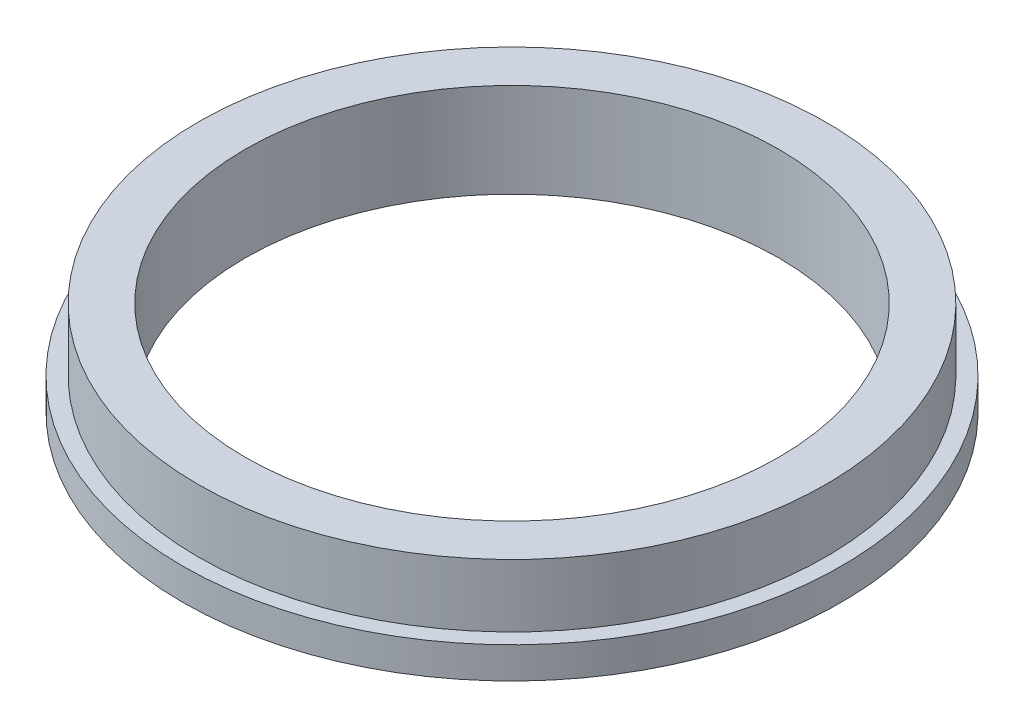
ISO-10303-21;
HEADER;
FILE_DESCRIPTION(('STEP AP214'),'2;1');
FILE_NAME('part.step','',(''),(''),'','','');
FILE_SCHEMA(('AUTOMOTIVE_DESIGN { 1 0 10303 214 1 1 1 1 }'));
ENDSEC;
DATA;
#1=APPLICATION_CONTEXT('core data for automotive mechanical design processes');
#2=APPLICATION_PROTOCOL_DEFINITION('international standard','automotive_design',2000,#1);
#3=PRODUCT_CONTEXT('',#1,'mechanical');
#4=PRODUCT('Part','Part','',(#3));
#5=PRODUCT_RELATED_PRODUCT_CATEGORY('part','',(#4));
#6=PRODUCT_DEFINITION_FORMATION('','',#4);
#7=PRODUCT_DEFINITION_CONTEXT('part definition',#1,'design');
#8=PRODUCT_DEFINITION('design','',#6,#7);
#9=PRODUCT_DEFINITION_SHAPE('','',#8);
#10=(LENGTH_UNIT() NAMED_UNIT(*) SI_UNIT(.MILLI.,.METRE.));
#11=(NAMED_UNIT(*) PLANE_ANGLE_UNIT() SI_UNIT($,.RADIAN.));
#12=(NAMED_UNIT(*) SI_UNIT($,.STERADIAN.) SOLID_ANGLE_UNIT());
#13=UNCERTAINTY_MEASURE_WITH_UNIT(LENGTH_MEASURE(1.E-05),#10,'distance_accuracy_value','');
#14=(GEOMETRIC_REPRESENTATION_CONTEXT(3) GLOBAL_UNCERTAINTY_ASSIGNED_CONTEXT((#13)) GLOBAL_UNIT_ASSIGNED_CONTEXT((#10,
#11,#12)) REPRESENTATION_CONTEXT('',''));
#15=CARTESIAN_POINT('',(0.,0.,0.));
#16=DIRECTION('',(0.,0.,1.));
#17=DIRECTION('',(1.,0.,0.));
#18=AXIS2_PLACEMENT_3D('',#15,#16,#17);
#19=CARTESIAN_POINT('',(0.,5.,0.));
#20=DIRECTION('',(0.,-1.,0.));
#21=DIRECTION('',(0.,0.,-1.));
#22=AXIS2_PLACEMENT_3D('',#19,#20,#21);
#23=CYLINDRICAL_SURFACE('',#22,52.5);
#24=CARTESIAN_POINT('',(0.,5.,0.));
#25=DIRECTION('',(0.,1.,0.));
#26=DIRECTION('',(0.,0.,1.));
#27=AXIS2_PLACEMENT_3D('',#24,#25,#26);
#28=CIRCLE('',#27,52.5);
#29=CARTESIAN_POINT('',(0.,5.,52.5));
#30=VERTEX_POINT('',#29);
#31=EDGE_CURVE('E10',#30,#30,#28,.T.);
#32=ORIENTED_EDGE('',*,*,#31,.F.);
#33=EDGE_LOOP('',(#32));
#34=FACE_BOUND('',#33,.T.);
#35=CARTESIAN_POINT('',(0.,0.,0.));
#36=DIRECTION('',(0.,1.,0.));
#37=DIRECTION('',(0.,0.,1.));
#38=AXIS2_PLACEMENT_3D('',#35,#36,#37);
#39=CIRCLE('',#38,52.5);
#40=CARTESIAN_POINT('',(0.,0.,52.5));
#41=VERTEX_POINT('',#40);
#42=EDGE_CURVE('E40',#41,#41,#39,.T.);
#43=ORIENTED_EDGE('',*,*,#42,.T.);
#44=EDGE_LOOP('',(#43));
#45=FACE_BOUND('',#44,.T.);
#46=ADVANCED_FACE('F37',(#34,#45),#23,.T.);
#47=CARTESIAN_POINT('',(0.,5.,0.));
#48=DIRECTION('',(0.,1.,0.));
#49=DIRECTION('',(0.,0.,1.));
#50=AXIS2_PLACEMENT_3D('',#47,#48,#49);
#51=PLANE('',#50);
#52=CARTESIAN_POINT('',(0.,5.,0.));
#53=DIRECTION('',(0.,1.,0.));
#54=DIRECTION('',(0.,0.,1.));
#55=AXIS2_PLACEMENT_3D('',#52,#53,#54);
#56=CIRCLE('',#55,50.);
#57=CARTESIAN_POINT('',(0.,5.,50.));
#58=VERTEX_POINT('',#57);
#59=EDGE_CURVE('E51',#58,#58,#56,.T.);
#60=ORIENTED_EDGE('',*,*,#59,.F.);
#61=EDGE_LOOP('',(#60));
#62=FACE_BOUND('',#61,.T.);
#63=ORIENTED_EDGE('',*,*,#31,.T.);
#64=EDGE_LOOP('',(#63));
#65=FACE_BOUND('',#64,.T.);
#66=ADVANCED_FACE('F83',(#62,#65),#51,.T.);
#67=CARTESIAN_POINT('',(0.,0.,0.));
#68=DIRECTION('',(0.,1.,0.));
#69=DIRECTION('',(0.,0.,1.));
#70=AXIS2_PLACEMENT_3D('',#67,#68,#69);
#71=PLANE('',#70);
#72=CARTESIAN_POINT('',(0.,0.,0.));
#73=DIRECTION('',(0.,1.,0.));
#74=DIRECTION('',(0.,0.,1.));
#75=AXIS2_PLACEMENT_3D('',#72,#73,#74);
#76=CIRCLE('',#75,42.5);
#77=CARTESIAN_POINT('',(0.,0.,42.5));
#78=VERTEX_POINT('',#77);
#79=EDGE_CURVE('E62',#78,#78,#76,.T.);
#80=ORIENTED_EDGE('',*,*,#79,.T.);
#81=EDGE_LOOP('',(#80));
#82=FACE_BOUND('',#81,.T.);
#83=ORIENTED_EDGE('',*,*,#42,.F.);
#84=EDGE_LOOP('',(#83));
#85=FACE_BOUND('',#84,.T.);
#86=ADVANCED_FACE('F67',(#82,#85),#71,.F.);
#87=CARTESIAN_POINT('',(0.,15.,0.));
#88=DIRECTION('',(0.,1.,0.));
#89=DIRECTION('',(0.,0.,1.));
#90=AXIS2_PLACEMENT_3D('',#87,#88,#89);
#91=PLANE('',#90);
#92=CARTESIAN_POINT('',(0.,15.,0.));
#93=DIRECTION('',(0.,1.,0.));
#94=DIRECTION('',(0.,0.,1.));
#95=AXIS2_PLACEMENT_3D('',#92,#93,#94);
#96=CIRCLE('',#95,50.);
#97=CARTESIAN_POINT('',(0.,15.,50.));
#98=VERTEX_POINT('',#97);
#99=EDGE_CURVE('E49',#98,#98,#96,.T.);
#100=ORIENTED_EDGE('',*,*,#99,.T.);
#101=EDGE_LOOP('',(#100));
#102=FACE_BOUND('',#101,.T.);
#103=CARTESIAN_POINT('',(0.,15.,0.));
#104=DIRECTION('',(0.,1.,0.));
#105=DIRECTION('',(0.,0.,1.));
#106=AXIS2_PLACEMENT_3D('',#103,#104,#105);
#107=CIRCLE('',#106,42.5);
#108=CARTESIAN_POINT('',(0.,15.,42.5));
#109=VERTEX_POINT('',#108);
#110=EDGE_CURVE('E55',#109,#109,#107,.T.);
#111=ORIENTED_EDGE('',*,*,#110,.F.);
#112=EDGE_LOOP('',(#111));
#113=FACE_BOUND('',#112,.T.);
#114=ADVANCED_FACE('F78',(#102,#113),#91,.T.);
#115=CARTESIAN_POINT('',(0.,15.,0.));
#116=DIRECTION('',(0.,-1.,0.));
#117=DIRECTION('',(0.,0.,-1.));
#118=AXIS2_PLACEMENT_3D('',#115,#116,#117);
#119=CYLINDRICAL_SURFACE('',#118,50.);
#120=ORIENTED_EDGE('',*,*,#99,.F.);
#121=EDGE_LOOP('',(#120));
#122=FACE_BOUND('',#121,.T.);
#123=ORIENTED_EDGE('',*,*,#59,.T.);
#124=EDGE_LOOP('',(#123));
#125=FACE_BOUND('',#124,.T.);
#126=ADVANCED_FACE('F72',(#122,#125),#119,.T.);
#127=CARTESIAN_POINT('',(0.,15.,0.));
#128=DIRECTION('',(0.,-1.,0.));
#129=DIRECTION('',(0.,0.,-1.));
#130=AXIS2_PLACEMENT_3D('',#127,#128,#129);
#131=CYLINDRICAL_SURFACE('',#130,42.5);
#132=ORIENTED_EDGE('',*,*,#110,.T.);
#133=EDGE_LOOP('',(#132));
#134=FACE_BOUND('',#133,.T.);
#135=ORIENTED_EDGE('',*,*,#79,.F.);
#136=EDGE_LOOP('',(#135));
#137=FACE_BOUND('',#136,.T.);
#138=ADVANCED_FACE('F70',(#134,#137),#131,.F.);
#139=CLOSED_SHELL('',(#46,#66,#86,#114,#126,#138));
#140=MANIFOLD_SOLID_BREP('B2',#139);
#141=ADVANCED_BREP_SHAPE_REPRESENTATION('',(#18,#140),#14);
#142=SHAPE_DEFINITION_REPRESENTATION(#9,#141);
ENDSEC;
END-ISO-10303-21;
